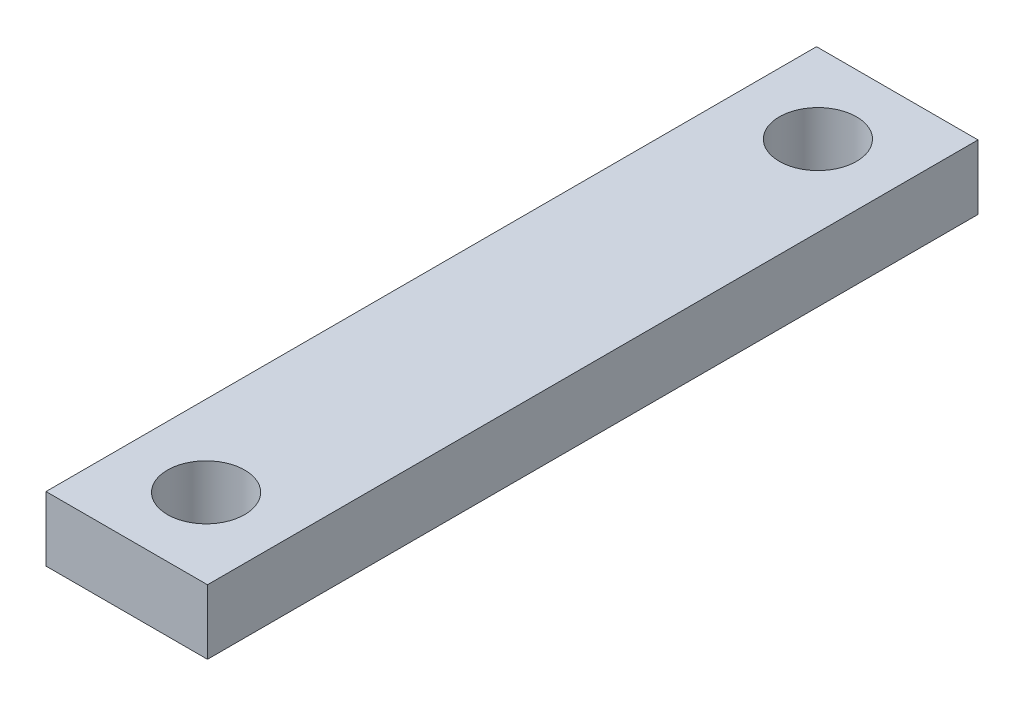
ISO-10303-21;
HEADER;
FILE_DESCRIPTION(('STEP AP214'),'2;1');
FILE_NAME('part.step','',(''),(''),'','','');
FILE_SCHEMA(('AUTOMOTIVE_DESIGN { 1 0 10303 214 1 1 1 1 }'));
ENDSEC;
DATA;
#1=APPLICATION_CONTEXT('core data for automotive mechanical design processes');
#2=APPLICATION_PROTOCOL_DEFINITION('international standard','automotive_design',2000,#1);
#3=PRODUCT_CONTEXT('',#1,'mechanical');
#4=PRODUCT('Part','Part','',(#3));
#5=PRODUCT_RELATED_PRODUCT_CATEGORY('part','',(#4));
#6=PRODUCT_DEFINITION_FORMATION('','',#4);
#7=PRODUCT_DEFINITION_CONTEXT('part definition',#1,'design');
#8=PRODUCT_DEFINITION('design','',#6,#7);
#9=PRODUCT_DEFINITION_SHAPE('','',#8);
#10=(LENGTH_UNIT() NAMED_UNIT(*) SI_UNIT(.MILLI.,.METRE.));
#11=(NAMED_UNIT(*) PLANE_ANGLE_UNIT() SI_UNIT($,.RADIAN.));
#12=(NAMED_UNIT(*) SI_UNIT($,.STERADIAN.) SOLID_ANGLE_UNIT());
#13=UNCERTAINTY_MEASURE_WITH_UNIT(LENGTH_MEASURE(1.E-05),#10,'distance_accuracy_value','');
#14=(GEOMETRIC_REPRESENTATION_CONTEXT(3) GLOBAL_UNCERTAINTY_ASSIGNED_CONTEXT((#13)) GLOBAL_UNIT_ASSIGNED_CONTEXT((#10,
#11,#12)) REPRESENTATION_CONTEXT('',''));
#15=CARTESIAN_POINT('',(0.,0.,0.));
#16=DIRECTION('',(0.,0.,1.));
#17=DIRECTION('',(1.,0.,0.));
#18=AXIS2_PLACEMENT_3D('',#15,#16,#17);
#19=CARTESIAN_POINT('',(0.,0.,37.875));
#20=DIRECTION('',(1.,0.,0.));
#21=DIRECTION('',(0.,0.,-1.));
#22=AXIS2_PLACEMENT_3D('',#19,#20,#21);
#23=PLANE('',#22);
#24=DIRECTION('',(0.,-1.,0.));
#25=VECTOR('',#24,1.);
#26=CARTESIAN_POINT('',(0.,0.,0.));
#27=LINE('',#26,#25);
#28=CARTESIAN_POINT('',(0.,3.175,0.));
#29=VERTEX_POINT('',#28);
#30=CARTESIAN_POINT('',(0.,0.,0.));
#31=VERTEX_POINT('',#30);
#32=EDGE_CURVE('E98',#29,#31,#27,.T.);
#33=ORIENTED_EDGE('',*,*,#32,.T.);
#34=DIRECTION('',(0.,0.,-1.));
#35=VECTOR('',#34,1.);
#36=CARTESIAN_POINT('',(0.,0.,37.875));
#37=LINE('',#36,#35);
#38=CARTESIAN_POINT('',(0.,0.,37.875));
#39=VERTEX_POINT('',#38);
#40=EDGE_CURVE('E11',#39,#31,#37,.T.);
#41=ORIENTED_EDGE('',*,*,#40,.F.);
#42=DIRECTION('',(0.,-1.,0.));
#43=VECTOR('',#42,1.);
#44=CARTESIAN_POINT('',(0.,0.,37.875));
#45=LINE('',#44,#43);
#46=CARTESIAN_POINT('',(0.,3.175,37.875));
#47=VERTEX_POINT('',#46);
#48=EDGE_CURVE('E86',#47,#39,#45,.T.);
#49=ORIENTED_EDGE('',*,*,#48,.F.);
#50=DIRECTION('',(0.,0.,-1.));
#51=VECTOR('',#50,1.);
#52=CARTESIAN_POINT('',(0.,3.175,37.875));
#53=LINE('',#52,#51);
#54=EDGE_CURVE('E94',#47,#29,#53,.T.);
#55=ORIENTED_EDGE('',*,*,#54,.T.);
#56=EDGE_LOOP('',(#33,#41,#49,#55));
#57=FACE_BOUND('',#56,.T.);
#58=ADVANCED_FACE('F35',(#57),#23,.F.);
#59=CARTESIAN_POINT('',(0.,0.,37.875));
#60=DIRECTION('',(0.,1.,0.));
#61=DIRECTION('',(0.,0.,1.));
#62=AXIS2_PLACEMENT_3D('',#59,#60,#61);
#63=PLANE('',#62);
#64=CARTESIAN_POINT('',(3.96875,0.,33.975));
#65=DIRECTION('',(0.,1.,0.));
#66=DIRECTION('',(0.,0.,1.));
#67=AXIS2_PLACEMENT_3D('',#64,#65,#66);
#68=CIRCLE('',#67,1.89865);
#69=CARTESIAN_POINT('',(3.96875,0.,35.87365));
#70=VERTEX_POINT('',#69);
#71=EDGE_CURVE('E115',#70,#70,#68,.T.);
#72=ORIENTED_EDGE('',*,*,#71,.T.);
#73=EDGE_LOOP('',(#72));
#74=FACE_BOUND('',#73,.T.);
#75=CARTESIAN_POINT('',(3.96875,0.,3.9));
#76=DIRECTION('',(0.,1.,0.));
#77=DIRECTION('',(0.,0.,1.));
#78=AXIS2_PLACEMENT_3D('',#75,#76,#77);
#79=CIRCLE('',#78,1.89865);
#80=CARTESIAN_POINT('',(3.96875,0.,5.79865));
#81=VERTEX_POINT('',#80);
#82=EDGE_CURVE('E101',#81,#81,#79,.T.);
#83=ORIENTED_EDGE('',*,*,#82,.T.);
#84=EDGE_LOOP('',(#83));
#85=FACE_BOUND('',#84,.T.);
#86=DIRECTION('',(1.,0.,0.));
#87=VECTOR('',#86,1.);
#88=CARTESIAN_POINT('',(0.,0.,0.));
#89=LINE('',#88,#87);
#90=CARTESIAN_POINT('',(7.9375,0.,0.));
#91=VERTEX_POINT('',#90);
#92=EDGE_CURVE('E90',#31,#91,#89,.T.);
#93=ORIENTED_EDGE('',*,*,#92,.T.);
#94=DIRECTION('',(0.,0.,-1.));
#95=VECTOR('',#94,1.);
#96=CARTESIAN_POINT('',(7.9375,0.,37.875));
#97=LINE('',#96,#95);
#98=CARTESIAN_POINT('',(7.9375,0.,37.875));
#99=VERTEX_POINT('',#98);
#100=EDGE_CURVE('E43',#99,#91,#97,.T.);
#101=ORIENTED_EDGE('',*,*,#100,.F.);
#102=DIRECTION('',(1.,0.,0.));
#103=VECTOR('',#102,1.);
#104=CARTESIAN_POINT('',(0.,0.,37.875));
#105=LINE('',#104,#103);
#106=EDGE_CURVE('E81',#39,#99,#105,.T.);
#107=ORIENTED_EDGE('',*,*,#106,.F.);
#108=ORIENTED_EDGE('',*,*,#40,.T.);
#109=EDGE_LOOP('',(#93,#101,#107,#108));
#110=FACE_BOUND('',#109,.T.);
#111=ADVANCED_FACE('F89',(#74,#85,#110),#63,.F.);
#112=CARTESIAN_POINT('',(7.9375,0.,37.875));
#113=DIRECTION('',(-1.,0.,0.));
#114=DIRECTION('',(0.,0.,1.));
#115=AXIS2_PLACEMENT_3D('',#112,#113,#114);
#116=PLANE('',#115);
#117=DIRECTION('',(0.,1.,0.));
#118=VECTOR('',#117,1.);
#119=CARTESIAN_POINT('',(7.9375,0.,0.));
#120=LINE('',#119,#118);
#121=CARTESIAN_POINT('',(7.9375,3.175,0.));
#122=VERTEX_POINT('',#121);
#123=EDGE_CURVE('E68',#91,#122,#120,.T.);
#124=ORIENTED_EDGE('',*,*,#123,.T.);
#125=DIRECTION('',(0.,0.,-1.));
#126=VECTOR('',#125,1.);
#127=CARTESIAN_POINT('',(7.9375,3.175,37.875));
#128=LINE('',#127,#126);
#129=CARTESIAN_POINT('',(7.9375,3.175,37.875));
#130=VERTEX_POINT('',#129);
#131=EDGE_CURVE('E91',#130,#122,#128,.T.);
#132=ORIENTED_EDGE('',*,*,#131,.F.);
#133=DIRECTION('',(0.,1.,0.));
#134=VECTOR('',#133,1.);
#135=CARTESIAN_POINT('',(7.9375,0.,37.875));
#136=LINE('',#135,#134);
#137=EDGE_CURVE('E84',#99,#130,#136,.T.);
#138=ORIENTED_EDGE('',*,*,#137,.F.);
#139=ORIENTED_EDGE('',*,*,#100,.T.);
#140=EDGE_LOOP('',(#124,#132,#138,#139));
#141=FACE_BOUND('',#140,.T.);
#142=ADVANCED_FACE('F92',(#141),#116,.F.);
#143=CARTESIAN_POINT('',(0.,3.175,37.875));
#144=DIRECTION('',(0.,-1.,0.));
#145=DIRECTION('',(0.,0.,-1.));
#146=AXIS2_PLACEMENT_3D('',#143,#144,#145);
#147=PLANE('',#146);
#148=CARTESIAN_POINT('',(3.96875,3.175,33.975));
#149=DIRECTION('',(0.,1.,0.));
#150=DIRECTION('',(0.,0.,1.));
#151=AXIS2_PLACEMENT_3D('',#148,#149,#150);
#152=CIRCLE('',#151,1.89865);
#153=CARTESIAN_POINT('',(3.96875,3.175,35.87365));
#154=VERTEX_POINT('',#153);
#155=EDGE_CURVE('E118',#154,#154,#152,.T.);
#156=ORIENTED_EDGE('',*,*,#155,.F.);
#157=EDGE_LOOP('',(#156));
#158=FACE_BOUND('',#157,.T.);
#159=CARTESIAN_POINT('',(3.96875,3.175,3.9));
#160=DIRECTION('',(0.,1.,0.));
#161=DIRECTION('',(0.,0.,1.));
#162=AXIS2_PLACEMENT_3D('',#159,#160,#161);
#163=CIRCLE('',#162,1.89865);
#164=CARTESIAN_POINT('',(3.96875,3.175,5.79865));
#165=VERTEX_POINT('',#164);
#166=EDGE_CURVE('E112',#165,#165,#163,.T.);
#167=ORIENTED_EDGE('',*,*,#166,.F.);
#168=EDGE_LOOP('',(#167));
#169=FACE_BOUND('',#168,.T.);
#170=DIRECTION('',(-1.,0.,0.));
#171=VECTOR('',#170,1.);
#172=CARTESIAN_POINT('',(0.,3.175,0.));
#173=LINE('',#172,#171);
#174=EDGE_CURVE('E74',#122,#29,#173,.T.);
#175=ORIENTED_EDGE('',*,*,#174,.T.);
#176=ORIENTED_EDGE('',*,*,#54,.F.);
#177=DIRECTION('',(-1.,0.,0.));
#178=VECTOR('',#177,1.);
#179=CARTESIAN_POINT('',(0.,3.175,37.875));
#180=LINE('',#179,#178);
#181=EDGE_CURVE('E51',#130,#47,#180,.T.);
#182=ORIENTED_EDGE('',*,*,#181,.F.);
#183=ORIENTED_EDGE('',*,*,#131,.T.);
#184=EDGE_LOOP('',(#175,#176,#182,#183));
#185=FACE_BOUND('',#184,.T.);
#186=ADVANCED_FACE('F106',(#158,#169,#185),#147,.F.);
#187=CARTESIAN_POINT('',(0.,0.,37.875));
#188=DIRECTION('',(0.,0.,-1.));
#189=DIRECTION('',(-1.,0.,0.));
#190=AXIS2_PLACEMENT_3D('',#187,#188,#189);
#191=PLANE('',#190);
#192=ORIENTED_EDGE('',*,*,#48,.T.);
#193=ORIENTED_EDGE('',*,*,#106,.T.);
#194=ORIENTED_EDGE('',*,*,#137,.T.);
#195=ORIENTED_EDGE('',*,*,#181,.T.);
#196=EDGE_LOOP('',(#192,#193,#194,#195));
#197=FACE_BOUND('',#196,.T.);
#198=ADVANCED_FACE('F82',(#197),#191,.F.);
#199=CARTESIAN_POINT('',(0.,0.,0.));
#200=DIRECTION('',(0.,0.,-1.));
#201=DIRECTION('',(-1.,0.,0.));
#202=AXIS2_PLACEMENT_3D('',#199,#200,#201);
#203=PLANE('',#202);
#204=ORIENTED_EDGE('',*,*,#32,.F.);
#205=ORIENTED_EDGE('',*,*,#174,.F.);
#206=ORIENTED_EDGE('',*,*,#123,.F.);
#207=ORIENTED_EDGE('',*,*,#92,.F.);
#208=EDGE_LOOP('',(#204,#205,#206,#207));
#209=FACE_BOUND('',#208,.T.);
#210=ADVANCED_FACE('F109',(#209),#203,.T.);
#211=CARTESIAN_POINT('',(3.96875,0.,3.9));
#212=DIRECTION('',(0.,1.,0.));
#213=DIRECTION('',(0.,0.,1.));
#214=AXIS2_PLACEMENT_3D('',#211,#212,#213);
#215=CYLINDRICAL_SURFACE('',#214,1.89865);
#216=ORIENTED_EDGE('',*,*,#82,.F.);
#217=EDGE_LOOP('',(#216));
#218=FACE_BOUND('',#217,.T.);
#219=ORIENTED_EDGE('',*,*,#166,.T.);
#220=EDGE_LOOP('',(#219));
#221=FACE_BOUND('',#220,.T.);
#222=ADVANCED_FACE('F129',(#218,#221),#215,.F.);
#223=CARTESIAN_POINT('',(3.96875,0.,33.975));
#224=DIRECTION('',(0.,1.,0.));
#225=DIRECTION('',(0.,0.,1.));
#226=AXIS2_PLACEMENT_3D('',#223,#224,#225);
#227=CYLINDRICAL_SURFACE('',#226,1.89865);
#228=ORIENTED_EDGE('',*,*,#71,.F.);
#229=EDGE_LOOP('',(#228));
#230=FACE_BOUND('',#229,.T.);
#231=ORIENTED_EDGE('',*,*,#155,.T.);
#232=EDGE_LOOP('',(#231));
#233=FACE_BOUND('',#232,.T.);
#234=ADVANCED_FACE('F126',(#230,#233),#227,.F.);
#235=CLOSED_SHELL('',(#58,#111,#142,#186,#198,#210,#222,#234));
#236=MANIFOLD_SOLID_BREP('B2',#235);
#237=ADVANCED_BREP_SHAPE_REPRESENTATION('',(#18,#236),#14);
#238=SHAPE_DEFINITION_REPRESENTATION(#9,#237);
ENDSEC;
END-ISO-10303-21;
